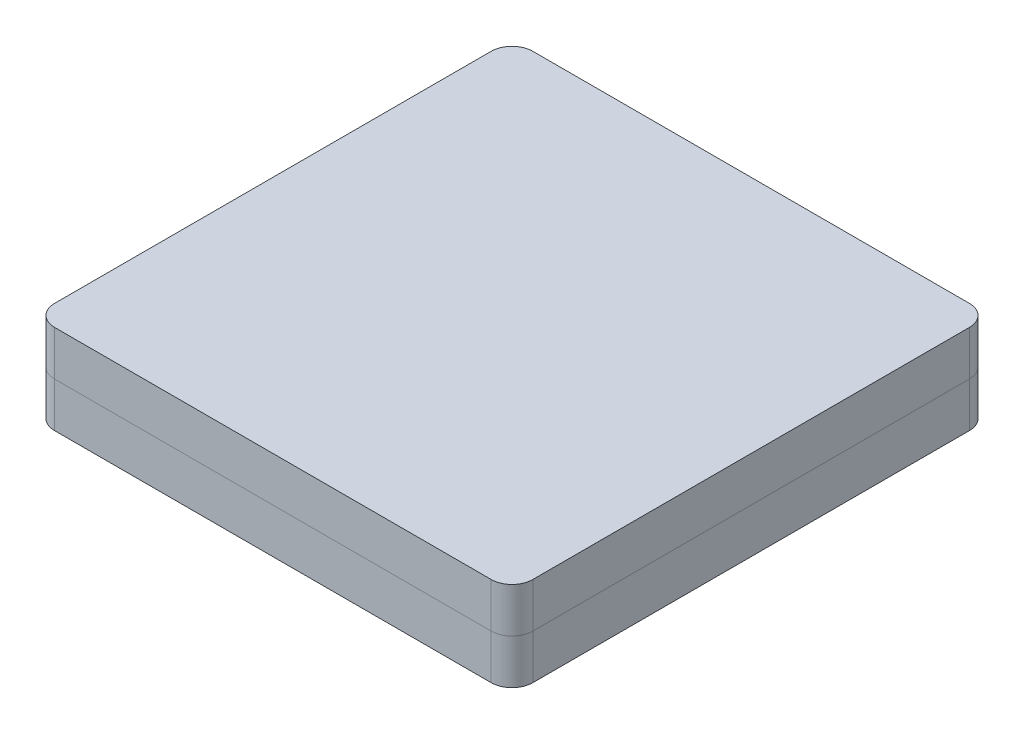
ISO-10303-21;
HEADER;
FILE_DESCRIPTION(('STEP AP214'),'2;1');
FILE_NAME('part.step','',(''),(''),'','','');
FILE_SCHEMA(('AUTOMOTIVE_DESIGN { 1 0 10303 214 1 1 1 1 }'));
ENDSEC;
DATA;
#1=APPLICATION_CONTEXT('core data for automotive mechanical design processes');
#2=APPLICATION_PROTOCOL_DEFINITION('international standard','automotive_design',2000,#1);
#3=PRODUCT_CONTEXT('',#1,'mechanical');
#4=PRODUCT('Part','Part','',(#3));
#5=PRODUCT_RELATED_PRODUCT_CATEGORY('part','',(#4));
#6=PRODUCT_DEFINITION_FORMATION('','',#4);
#7=PRODUCT_DEFINITION_CONTEXT('part definition',#1,'design');
#8=PRODUCT_DEFINITION('design','',#6,#7);
#9=PRODUCT_DEFINITION_SHAPE('','',#8);
#10=(LENGTH_UNIT() NAMED_UNIT(*) SI_UNIT(.MILLI.,.METRE.));
#11=(NAMED_UNIT(*) PLANE_ANGLE_UNIT() SI_UNIT($,.RADIAN.));
#12=(NAMED_UNIT(*) SI_UNIT($,.STERADIAN.) SOLID_ANGLE_UNIT());
#13=UNCERTAINTY_MEASURE_WITH_UNIT(LENGTH_MEASURE(1.E-05),#10,'distance_accuracy_value','');
#14=(GEOMETRIC_REPRESENTATION_CONTEXT(3) GLOBAL_UNCERTAINTY_ASSIGNED_CONTEXT((#13)) GLOBAL_UNIT_ASSIGNED_CONTEXT((#10,
#11,#12)) REPRESENTATION_CONTEXT('',''));
#15=CARTESIAN_POINT('',(0.,0.,0.));
#16=DIRECTION('',(0.,0.,1.));
#17=DIRECTION('',(1.,0.,0.));
#18=AXIS2_PLACEMENT_3D('',#15,#16,#17);
#19=CARTESIAN_POINT('',(0.,2.15,0.));
#20=DIRECTION('',(0.,1.,0.));
#21=DIRECTION('',(0.,0.,1.));
#22=AXIS2_PLACEMENT_3D('',#19,#20,#21);
#23=PLANE('',#22);
#24=DIRECTION('',(0.,0.,1.));
#25=VECTOR('',#24,1.);
#26=CARTESIAN_POINT('',(-11.5,2.15,10.5));
#27=LINE('',#26,#25);
#28=CARTESIAN_POINT('',(-11.5,2.15,-10.5));
#29=VERTEX_POINT('',#28);
#30=CARTESIAN_POINT('',(-11.5,2.15,10.5));
#31=VERTEX_POINT('',#30);
#32=EDGE_CURVE('E120',#29,#31,#27,.T.);
#33=ORIENTED_EDGE('',*,*,#32,.T.);
#34=CARTESIAN_POINT('',(-10.5,2.15,10.5));
#35=DIRECTION('',(0.,1.,0.));
#36=DIRECTION('',(0.,0.,1.));
#37=AXIS2_PLACEMENT_3D('',#34,#35,#36);
#38=CIRCLE('',#37,0.999999999999999);
#39=CARTESIAN_POINT('',(-10.5,2.15,11.5));
#40=VERTEX_POINT('',#39);
#41=EDGE_CURVE('E127',#31,#40,#38,.T.);
#42=ORIENTED_EDGE('',*,*,#41,.T.);
#43=DIRECTION('',(1.,0.,0.));
#44=VECTOR('',#43,1.);
#45=CARTESIAN_POINT('',(-10.5,2.15,11.5));
#46=LINE('',#45,#44);
#47=CARTESIAN_POINT('',(10.5,2.15,11.5));
#48=VERTEX_POINT('',#47);
#49=EDGE_CURVE('E131',#40,#48,#46,.T.);
#50=ORIENTED_EDGE('',*,*,#49,.T.);
#51=CARTESIAN_POINT('',(10.5,2.15,10.5));
#52=DIRECTION('',(0.,1.,0.));
#53=DIRECTION('',(0.,0.,1.));
#54=AXIS2_PLACEMENT_3D('',#51,#52,#53);
#55=CIRCLE('',#54,0.999999999999999);
#56=CARTESIAN_POINT('',(11.5,2.15,10.5));
#57=VERTEX_POINT('',#56);
#58=EDGE_CURVE('E175',#48,#57,#55,.T.);
#59=ORIENTED_EDGE('',*,*,#58,.T.);
#60=DIRECTION('',(0.,0.,-1.));
#61=VECTOR('',#60,1.);
#62=CARTESIAN_POINT('',(11.5,2.15,10.5));
#63=LINE('',#62,#61);
#64=CARTESIAN_POINT('',(11.5,2.15,-10.5));
#65=VERTEX_POINT('',#64);
#66=EDGE_CURVE('E178',#57,#65,#63,.T.);
#67=ORIENTED_EDGE('',*,*,#66,.T.);
#68=CARTESIAN_POINT('',(10.5,2.15,-10.5));
#69=DIRECTION('',(0.,1.,0.));
#70=DIRECTION('',(0.,0.,1.));
#71=AXIS2_PLACEMENT_3D('',#68,#69,#70);
#72=CIRCLE('',#71,0.999999999999999);
#73=CARTESIAN_POINT('',(10.5,2.15,-11.5));
#74=VERTEX_POINT('',#73);
#75=EDGE_CURVE('E181',#65,#74,#72,.T.);
#76=ORIENTED_EDGE('',*,*,#75,.T.);
#77=DIRECTION('',(-1.,0.,0.));
#78=VECTOR('',#77,1.);
#79=CARTESIAN_POINT('',(-10.5,2.15,-11.5));
#80=LINE('',#79,#78);
#81=CARTESIAN_POINT('',(-10.5,2.15,-11.5));
#82=VERTEX_POINT('',#81);
#83=EDGE_CURVE('E138',#74,#82,#80,.T.);
#84=ORIENTED_EDGE('',*,*,#83,.T.);
#85=CARTESIAN_POINT('',(-10.5,2.15,-10.5));
#86=DIRECTION('',(0.,1.,0.));
#87=DIRECTION('',(0.,0.,1.));
#88=AXIS2_PLACEMENT_3D('',#85,#86,#87);
#89=CIRCLE('',#88,0.999999999999999);
#90=EDGE_CURVE('E136',#82,#29,#89,.T.);
#91=ORIENTED_EDGE('',*,*,#90,.T.);
#92=EDGE_LOOP('',(#33,#42,#50,#59,#67,#76,#84,#91));
#93=FACE_BOUND('',#92,.T.);
#94=ADVANCED_FACE('F50',(#93),#23,.T.);
#95=CARTESIAN_POINT('',(-10.5,4.3,10.5));
#96=DIRECTION('',(0.,-1.,0.));
#97=DIRECTION('',(0.,0.,-1.));
#98=AXIS2_PLACEMENT_3D('',#95,#96,#97);
#99=CYLINDRICAL_SURFACE('',#98,0.999999999999999);
#100=ORIENTED_EDGE('',*,*,#41,.F.);
#101=DIRECTION('',(0.,-1.,0.));
#102=VECTOR('',#101,1.);
#103=CARTESIAN_POINT('',(-11.5,4.3,10.5));
#104=LINE('',#103,#102);
#105=CARTESIAN_POINT('',(-11.5,0.,10.5));
#106=VERTEX_POINT('',#105);
#107=EDGE_CURVE('E54',#31,#106,#104,.T.);
#108=ORIENTED_EDGE('',*,*,#107,.T.);
#109=CARTESIAN_POINT('',(-10.5,0.,10.5));
#110=DIRECTION('',(0.,1.,0.));
#111=DIRECTION('',(0.,0.,-1.));
#112=AXIS2_PLACEMENT_3D('',#109,#110,#111);
#113=CIRCLE('',#112,0.999999999999999);
#114=CARTESIAN_POINT('',(-10.5,0.,11.5));
#115=VERTEX_POINT('',#114);
#116=EDGE_CURVE('E13',#106,#115,#113,.T.);
#117=ORIENTED_EDGE('',*,*,#116,.T.);
#118=DIRECTION('',(0.,-1.,0.));
#119=VECTOR('',#118,1.);
#120=CARTESIAN_POINT('',(-10.5,4.3,11.5));
#121=LINE('',#120,#119);
#122=EDGE_CURVE('E67',#40,#115,#121,.T.);
#123=ORIENTED_EDGE('',*,*,#122,.F.);
#124=EDGE_LOOP('',(#100,#108,#117,#123));
#125=FACE_BOUND('',#124,.T.);
#126=ADVANCED_FACE('F128',(#125),#99,.T.);
#127=CARTESIAN_POINT('',(-10.5,4.3,11.5));
#128=DIRECTION('',(0.,0.,-1.));
#129=DIRECTION('',(-1.,0.,0.));
#130=AXIS2_PLACEMENT_3D('',#127,#128,#129);
#131=PLANE('',#130);
#132=ORIENTED_EDGE('',*,*,#49,.F.);
#133=ORIENTED_EDGE('',*,*,#122,.T.);
#134=DIRECTION('',(1.,0.,0.));
#135=VECTOR('',#134,1.);
#136=CARTESIAN_POINT('',(-10.5,0.,11.5));
#137=LINE('',#136,#135);
#138=CARTESIAN_POINT('',(10.5,0.,11.5));
#139=VERTEX_POINT('',#138);
#140=EDGE_CURVE('E59',#115,#139,#137,.T.);
#141=ORIENTED_EDGE('',*,*,#140,.T.);
#142=DIRECTION('',(0.,-1.,0.));
#143=VECTOR('',#142,1.);
#144=CARTESIAN_POINT('',(10.5,4.3,11.5));
#145=LINE('',#144,#143);
#146=EDGE_CURVE('E75',#48,#139,#145,.T.);
#147=ORIENTED_EDGE('',*,*,#146,.F.);
#148=EDGE_LOOP('',(#132,#133,#141,#147));
#149=FACE_BOUND('',#148,.T.);
#150=ADVANCED_FACE('F196',(#149),#131,.F.);
#151=CARTESIAN_POINT('',(10.5,4.3,10.5));
#152=DIRECTION('',(0.,-1.,0.));
#153=DIRECTION('',(0.,0.,-1.));
#154=AXIS2_PLACEMENT_3D('',#151,#152,#153);
#155=CYLINDRICAL_SURFACE('',#154,0.999999999999999);
#156=ORIENTED_EDGE('',*,*,#58,.F.);
#157=ORIENTED_EDGE('',*,*,#146,.T.);
#158=CARTESIAN_POINT('',(10.5,0.,10.5));
#159=DIRECTION('',(0.,1.,0.));
#160=DIRECTION('',(0.,0.,1.));
#161=AXIS2_PLACEMENT_3D('',#158,#159,#160);
#162=CIRCLE('',#161,0.999999999999999);
#163=CARTESIAN_POINT('',(11.5,0.,10.5));
#164=VERTEX_POINT('',#163);
#165=EDGE_CURVE('E171',#139,#164,#162,.T.);
#166=ORIENTED_EDGE('',*,*,#165,.T.);
#167=DIRECTION('',(0.,-1.,0.));
#168=VECTOR('',#167,1.);
#169=CARTESIAN_POINT('',(11.5,4.3,10.5));
#170=LINE('',#169,#168);
#171=EDGE_CURVE('E144',#57,#164,#170,.T.);
#172=ORIENTED_EDGE('',*,*,#171,.F.);
#173=EDGE_LOOP('',(#156,#157,#166,#172));
#174=FACE_BOUND('',#173,.T.);
#175=ADVANCED_FACE('F195',(#174),#155,.T.);
#176=CARTESIAN_POINT('',(11.5,4.3,10.5));
#177=DIRECTION('',(-1.,0.,0.));
#178=DIRECTION('',(0.,0.,1.));
#179=AXIS2_PLACEMENT_3D('',#176,#177,#178);
#180=PLANE('',#179);
#181=ORIENTED_EDGE('',*,*,#66,.F.);
#182=ORIENTED_EDGE('',*,*,#171,.T.);
#183=DIRECTION('',(0.,0.,-1.));
#184=VECTOR('',#183,1.);
#185=CARTESIAN_POINT('',(11.5,0.,10.5));
#186=LINE('',#185,#184);
#187=CARTESIAN_POINT('',(11.5,0.,-10.5));
#188=VERTEX_POINT('',#187);
#189=EDGE_CURVE('E168',#164,#188,#186,.T.);
#190=ORIENTED_EDGE('',*,*,#189,.T.);
#191=DIRECTION('',(0.,-1.,0.));
#192=VECTOR('',#191,1.);
#193=CARTESIAN_POINT('',(11.5,4.3,-10.5));
#194=LINE('',#193,#192);
#195=EDGE_CURVE('E146',#65,#188,#194,.T.);
#196=ORIENTED_EDGE('',*,*,#195,.F.);
#197=EDGE_LOOP('',(#181,#182,#190,#196));
#198=FACE_BOUND('',#197,.T.);
#199=ADVANCED_FACE('F194',(#198),#180,.F.);
#200=CARTESIAN_POINT('',(10.5,4.3,-10.5));
#201=DIRECTION('',(0.,-1.,0.));
#202=DIRECTION('',(0.,0.,-1.));
#203=AXIS2_PLACEMENT_3D('',#200,#201,#202);
#204=CYLINDRICAL_SURFACE('',#203,0.999999999999999);
#205=ORIENTED_EDGE('',*,*,#75,.F.);
#206=ORIENTED_EDGE('',*,*,#195,.T.);
#207=CARTESIAN_POINT('',(10.5,0.,-10.5));
#208=DIRECTION('',(0.,1.,0.));
#209=DIRECTION('',(0.,0.,-1.));
#210=AXIS2_PLACEMENT_3D('',#207,#208,#209);
#211=CIRCLE('',#210,0.999999999999999);
#212=CARTESIAN_POINT('',(10.5,0.,-11.5));
#213=VERTEX_POINT('',#212);
#214=EDGE_CURVE('E165',#188,#213,#211,.T.);
#215=ORIENTED_EDGE('',*,*,#214,.T.);
#216=DIRECTION('',(0.,-1.,0.));
#217=VECTOR('',#216,1.);
#218=CARTESIAN_POINT('',(10.5,4.3,-11.5));
#219=LINE('',#218,#217);
#220=EDGE_CURVE('E148',#74,#213,#219,.T.);
#221=ORIENTED_EDGE('',*,*,#220,.F.);
#222=EDGE_LOOP('',(#205,#206,#215,#221));
#223=FACE_BOUND('',#222,.T.);
#224=ADVANCED_FACE('F191',(#223),#204,.T.);
#225=CARTESIAN_POINT('',(-10.5,4.3,-11.5));
#226=DIRECTION('',(0.,0.,1.));
#227=DIRECTION('',(1.,0.,0.));
#228=AXIS2_PLACEMENT_3D('',#225,#226,#227);
#229=PLANE('',#228);
#230=ORIENTED_EDGE('',*,*,#83,.F.);
#231=ORIENTED_EDGE('',*,*,#220,.T.);
#232=DIRECTION('',(-1.,0.,0.));
#233=VECTOR('',#232,1.);
#234=CARTESIAN_POINT('',(-10.5,0.,-11.5));
#235=LINE('',#234,#233);
#236=CARTESIAN_POINT('',(-10.5,0.,-11.5));
#237=VERTEX_POINT('',#236);
#238=EDGE_CURVE('E159',#213,#237,#235,.T.);
#239=ORIENTED_EDGE('',*,*,#238,.T.);
#240=DIRECTION('',(0.,-1.,0.));
#241=VECTOR('',#240,1.);
#242=CARTESIAN_POINT('',(-10.5,4.3,-11.5));
#243=LINE('',#242,#241);
#244=EDGE_CURVE('E150',#82,#237,#243,.T.);
#245=ORIENTED_EDGE('',*,*,#244,.F.);
#246=EDGE_LOOP('',(#230,#231,#239,#245));
#247=FACE_BOUND('',#246,.T.);
#248=ADVANCED_FACE('F186',(#247),#229,.F.);
#249=CARTESIAN_POINT('',(-10.5,4.3,-10.5));
#250=DIRECTION('',(0.,-1.,0.));
#251=DIRECTION('',(0.,0.,-1.));
#252=AXIS2_PLACEMENT_3D('',#249,#250,#251);
#253=CYLINDRICAL_SURFACE('',#252,0.999999999999999);
#254=ORIENTED_EDGE('',*,*,#90,.F.);
#255=ORIENTED_EDGE('',*,*,#244,.T.);
#256=CARTESIAN_POINT('',(-10.5,0.,-10.5));
#257=DIRECTION('',(0.,1.,0.));
#258=DIRECTION('',(0.,0.,-1.));
#259=AXIS2_PLACEMENT_3D('',#256,#257,#258);
#260=CIRCLE('',#259,0.999999999999999);
#261=CARTESIAN_POINT('',(-11.5,0.,-10.5));
#262=VERTEX_POINT('',#261);
#263=EDGE_CURVE('E154',#237,#262,#260,.T.);
#264=ORIENTED_EDGE('',*,*,#263,.T.);
#265=DIRECTION('',(0.,-1.,0.));
#266=VECTOR('',#265,1.);
#267=CARTESIAN_POINT('',(-11.5,4.3,-10.5));
#268=LINE('',#267,#266);
#269=EDGE_CURVE('E125',#29,#262,#268,.T.);
#270=ORIENTED_EDGE('',*,*,#269,.F.);
#271=EDGE_LOOP('',(#254,#255,#264,#270));
#272=FACE_BOUND('',#271,.T.);
#273=ADVANCED_FACE('F155',(#272),#253,.T.);
#274=CARTESIAN_POINT('',(-11.5,4.3,10.5));
#275=DIRECTION('',(1.,0.,0.));
#276=DIRECTION('',(0.,0.,-1.));
#277=AXIS2_PLACEMENT_3D('',#274,#275,#276);
#278=PLANE('',#277);
#279=ORIENTED_EDGE('',*,*,#32,.F.);
#280=ORIENTED_EDGE('',*,*,#269,.T.);
#281=DIRECTION('',(0.,0.,1.));
#282=VECTOR('',#281,1.);
#283=CARTESIAN_POINT('',(-11.5,0.,10.5));
#284=LINE('',#283,#282);
#285=EDGE_CURVE('E122',#262,#106,#284,.T.);
#286=ORIENTED_EDGE('',*,*,#285,.T.);
#287=ORIENTED_EDGE('',*,*,#107,.F.);
#288=EDGE_LOOP('',(#279,#280,#286,#287));
#289=FACE_BOUND('',#288,.T.);
#290=ADVANCED_FACE('F52',(#289),#278,.F.);
#291=CARTESIAN_POINT('',(-10.5,0.,10.5));
#292=DIRECTION('',(0.,-1.,0.));
#293=DIRECTION('',(0.,0.,-1.));
#294=AXIS2_PLACEMENT_3D('',#291,#292,#293);
#295=PLANE('',#294);
#296=ORIENTED_EDGE('',*,*,#116,.F.);
#297=ORIENTED_EDGE('',*,*,#285,.F.);
#298=ORIENTED_EDGE('',*,*,#263,.F.);
#299=ORIENTED_EDGE('',*,*,#238,.F.);
#300=ORIENTED_EDGE('',*,*,#214,.F.);
#301=ORIENTED_EDGE('',*,*,#189,.F.);
#302=ORIENTED_EDGE('',*,*,#165,.F.);
#303=ORIENTED_EDGE('',*,*,#140,.F.);
#304=EDGE_LOOP('',(#296,#297,#298,#299,#300,#301,#302,#303));
#305=FACE_BOUND('',#304,.T.);
#306=ADVANCED_FACE('F161',(#305),#295,.T.);
#307=CLOSED_SHELL('',(#94,#126,#150,#175,#199,#224,#248,#273,#290,#306));
#308=MANIFOLD_SOLID_BREP('B2',#307);
#309=CARTESIAN_POINT('',(0.,2.15,0.));
#310=DIRECTION('',(0.,1.,0.));
#311=DIRECTION('',(0.,0.,1.));
#312=AXIS2_PLACEMENT_3D('',#309,#310,#311);
#313=PLANE('',#312);
#314=DIRECTION('',(0.,0.,1.));
#315=VECTOR('',#314,1.);
#316=CARTESIAN_POINT('',(-11.5,2.15,10.5));
#317=LINE('',#316,#315);
#318=CARTESIAN_POINT('',(-11.5,2.15,-10.5));
#319=VERTEX_POINT('',#318);
#320=CARTESIAN_POINT('',(-11.5,2.15,10.5));
#321=VERTEX_POINT('',#320);
#322=EDGE_CURVE('E356',#319,#321,#317,.T.);
#323=ORIENTED_EDGE('',*,*,#322,.F.);
#324=CARTESIAN_POINT('',(-10.5,2.15,-10.5));
#325=DIRECTION('',(0.,1.,0.));
#326=DIRECTION('',(0.,0.,1.));
#327=AXIS2_PLACEMENT_3D('',#324,#325,#326);
#328=CIRCLE('',#327,0.999999999999999);
#329=CARTESIAN_POINT('',(-10.5,2.15,-11.5));
#330=VERTEX_POINT('',#329);
#331=EDGE_CURVE('E359',#330,#319,#328,.T.);
#332=ORIENTED_EDGE('',*,*,#331,.F.);
#333=DIRECTION('',(-1.,0.,0.));
#334=VECTOR('',#333,1.);
#335=CARTESIAN_POINT('',(-10.5,2.15,-11.5));
#336=LINE('',#335,#334);
#337=CARTESIAN_POINT('',(10.5,2.15,-11.5));
#338=VERTEX_POINT('',#337);
#339=EDGE_CURVE('E366',#338,#330,#336,.T.);
#340=ORIENTED_EDGE('',*,*,#339,.F.);
#341=CARTESIAN_POINT('',(10.5,2.15,-10.5));
#342=DIRECTION('',(0.,1.,0.));
#343=DIRECTION('',(0.,0.,1.));
#344=AXIS2_PLACEMENT_3D('',#341,#342,#343);
#345=CIRCLE('',#344,0.999999999999999);
#346=CARTESIAN_POINT('',(11.5,2.15,-10.5));
#347=VERTEX_POINT('',#346);
#348=EDGE_CURVE('E368',#347,#338,#345,.T.);
#349=ORIENTED_EDGE('',*,*,#348,.F.);
#350=DIRECTION('',(0.,0.,-1.));
#351=VECTOR('',#350,1.);
#352=CARTESIAN_POINT('',(11.5,2.15,10.5));
#353=LINE('',#352,#351);
#354=CARTESIAN_POINT('',(11.5,2.15,10.5));
#355=VERTEX_POINT('',#354);
#356=EDGE_CURVE('E370',#355,#347,#353,.T.);
#357=ORIENTED_EDGE('',*,*,#356,.F.);
#358=CARTESIAN_POINT('',(10.5,2.15,10.5));
#359=DIRECTION('',(0.,1.,0.));
#360=DIRECTION('',(0.,0.,1.));
#361=AXIS2_PLACEMENT_3D('',#358,#359,#360);
#362=CIRCLE('',#361,0.999999999999999);
#363=CARTESIAN_POINT('',(10.5,2.15,11.5));
#364=VERTEX_POINT('',#363);
#365=EDGE_CURVE('E372',#364,#355,#362,.T.);
#366=ORIENTED_EDGE('',*,*,#365,.F.);
#367=DIRECTION('',(1.,0.,0.));
#368=VECTOR('',#367,1.);
#369=CARTESIAN_POINT('',(-10.5,2.15,11.5));
#370=LINE('',#369,#368);
#371=CARTESIAN_POINT('',(-10.5,2.15,11.5));
#372=VERTEX_POINT('',#371);
#373=EDGE_CURVE('E285',#372,#364,#370,.T.);
#374=ORIENTED_EDGE('',*,*,#373,.F.);
#375=CARTESIAN_POINT('',(-10.5,2.15,10.5));
#376=DIRECTION('',(0.,1.,0.));
#377=DIRECTION('',(0.,0.,1.));
#378=AXIS2_PLACEMENT_3D('',#375,#376,#377);
#379=CIRCLE('',#378,0.999999999999999);
#380=EDGE_CURVE('E48',#321,#372,#379,.T.);
#381=ORIENTED_EDGE('',*,*,#380,.F.);
#382=EDGE_LOOP('',(#323,#332,#340,#349,#357,#366,#374,#381));
#383=FACE_BOUND('',#382,.T.);
#384=ADVANCED_FACE('F278',(#383),#313,.F.);
#385=CARTESIAN_POINT('',(-10.5,4.3,11.5));
#386=DIRECTION('',(0.,0.,-1.));
#387=DIRECTION('',(-1.,0.,0.));
#388=AXIS2_PLACEMENT_3D('',#385,#386,#387);
#389=PLANE('',#388);
#390=DIRECTION('',(0.,-1.,0.));
#391=VECTOR('',#390,1.);
#392=CARTESIAN_POINT('',(-10.5,4.3,11.5));
#393=LINE('',#392,#391);
#394=CARTESIAN_POINT('',(-10.5,4.3,11.5));
#395=VERTEX_POINT('',#394);
#396=EDGE_CURVE('E341',#395,#372,#393,.T.);
#397=ORIENTED_EDGE('',*,*,#396,.T.);
#398=ORIENTED_EDGE('',*,*,#373,.T.);
#399=DIRECTION('',(0.,-1.,0.));
#400=VECTOR('',#399,1.);
#401=CARTESIAN_POINT('',(10.5,4.3,11.5));
#402=LINE('',#401,#400);
#403=CARTESIAN_POINT('',(10.5,4.3,11.5));
#404=VERTEX_POINT('',#403);
#405=EDGE_CURVE('E343',#404,#364,#402,.T.);
#406=ORIENTED_EDGE('',*,*,#405,.F.);
#407=DIRECTION('',(1.,0.,0.));
#408=VECTOR('',#407,1.);
#409=CARTESIAN_POINT('',(-10.5,4.3,11.5));
#410=LINE('',#409,#408);
#411=EDGE_CURVE('E338',#395,#404,#410,.T.);
#412=ORIENTED_EDGE('',*,*,#411,.F.);
#413=EDGE_LOOP('',(#397,#398,#406,#412));
#414=FACE_BOUND('',#413,.T.);
#415=ADVANCED_FACE('F340',(#414),#389,.F.);
#416=CARTESIAN_POINT('',(10.5,4.3,10.5));
#417=DIRECTION('',(0.,-1.,0.));
#418=DIRECTION('',(0.,0.,-1.));
#419=AXIS2_PLACEMENT_3D('',#416,#417,#418);
#420=CYLINDRICAL_SURFACE('',#419,0.999999999999999);
#421=ORIENTED_EDGE('',*,*,#405,.T.);
#422=ORIENTED_EDGE('',*,*,#365,.T.);
#423=DIRECTION('',(0.,-1.,0.));
#424=VECTOR('',#423,1.);
#425=CARTESIAN_POINT('',(11.5,4.3,10.5));
#426=LINE('',#425,#424);
#427=CARTESIAN_POINT('',(11.5,4.3,10.5));
#428=VERTEX_POINT('',#427);
#429=EDGE_CURVE('E361',#428,#355,#426,.T.);
#430=ORIENTED_EDGE('',*,*,#429,.F.);
#431=CARTESIAN_POINT('',(10.5,4.3,10.5));
#432=DIRECTION('',(0.,1.,0.));
#433=DIRECTION('',(0.,0.,1.));
#434=AXIS2_PLACEMENT_3D('',#431,#432,#433);
#435=CIRCLE('',#434,0.999999999999999);
#436=EDGE_CURVE('E346',#404,#428,#435,.T.);
#437=ORIENTED_EDGE('',*,*,#436,.F.);
#438=EDGE_LOOP('',(#421,#422,#430,#437));
#439=FACE_BOUND('',#438,.T.);
#440=ADVANCED_FACE('F376',(#439),#420,.T.);
#441=CARTESIAN_POINT('',(11.5,4.3,10.5));
#442=DIRECTION('',(-1.,0.,0.));
#443=DIRECTION('',(0.,0.,1.));
#444=AXIS2_PLACEMENT_3D('',#441,#442,#443);
#445=PLANE('',#444);
#446=ORIENTED_EDGE('',*,*,#429,.T.);
#447=ORIENTED_EDGE('',*,*,#356,.T.);
#448=DIRECTION('',(0.,-1.,0.));
#449=VECTOR('',#448,1.);
#450=CARTESIAN_POINT('',(11.5,4.3,-10.5));
#451=LINE('',#450,#449);
#452=CARTESIAN_POINT('',(11.5,4.3,-10.5));
#453=VERTEX_POINT('',#452);
#454=EDGE_CURVE('E388',#453,#347,#451,.T.);
#455=ORIENTED_EDGE('',*,*,#454,.F.);
#456=DIRECTION('',(0.,0.,-1.));
#457=VECTOR('',#456,1.);
#458=CARTESIAN_POINT('',(11.5,4.3,10.5));
#459=LINE('',#458,#457);
#460=EDGE_CURVE('E387',#428,#453,#459,.T.);
#461=ORIENTED_EDGE('',*,*,#460,.F.);
#462=EDGE_LOOP('',(#446,#447,#455,#461));
#463=FACE_BOUND('',#462,.T.);
#464=ADVANCED_FACE('F386',(#463),#445,.F.);
#465=CARTESIAN_POINT('',(10.5,4.3,-10.5));
#466=DIRECTION('',(0.,-1.,0.));
#467=DIRECTION('',(0.,0.,-1.));
#468=AXIS2_PLACEMENT_3D('',#465,#466,#467);
#469=CYLINDRICAL_SURFACE('',#468,0.999999999999999);
#470=ORIENTED_EDGE('',*,*,#454,.T.);
#471=ORIENTED_EDGE('',*,*,#348,.T.);
#472=DIRECTION('',(0.,-1.,0.));
#473=VECTOR('',#472,1.);
#474=CARTESIAN_POINT('',(10.5,4.3,-11.5));
#475=LINE('',#474,#473);
#476=CARTESIAN_POINT('',(10.5,4.3,-11.5));
#477=VERTEX_POINT('',#476);
#478=EDGE_CURVE('E389',#477,#338,#475,.T.);
#479=ORIENTED_EDGE('',*,*,#478,.F.);
#480=CARTESIAN_POINT('',(10.5,4.3,-10.5));
#481=DIRECTION('',(0.,1.,0.));
#482=DIRECTION('',(0.,0.,-1.));
#483=AXIS2_PLACEMENT_3D('',#480,#481,#482);
#484=CIRCLE('',#483,0.999999999999999);
#485=EDGE_CURVE('E407',#453,#477,#484,.T.);
#486=ORIENTED_EDGE('',*,*,#485,.F.);
#487=EDGE_LOOP('',(#470,#471,#479,#486));
#488=FACE_BOUND('',#487,.T.);
#489=ADVANCED_FACE('F413',(#488),#469,.T.);
#490=CARTESIAN_POINT('',(-10.5,4.3,-11.5));
#491=DIRECTION('',(0.,0.,1.));
#492=DIRECTION('',(1.,0.,0.));
#493=AXIS2_PLACEMENT_3D('',#490,#491,#492);
#494=PLANE('',#493);
#495=ORIENTED_EDGE('',*,*,#478,.T.);
#496=ORIENTED_EDGE('',*,*,#339,.T.);
#497=DIRECTION('',(0.,-1.,0.));
#498=VECTOR('',#497,1.);
#499=CARTESIAN_POINT('',(-10.5,4.3,-11.5));
#500=LINE('',#499,#498);
#501=CARTESIAN_POINT('',(-10.5,4.3,-11.5));
#502=VERTEX_POINT('',#501);
#503=EDGE_CURVE('E394',#502,#330,#500,.T.);
#504=ORIENTED_EDGE('',*,*,#503,.F.);
#505=DIRECTION('',(-1.,0.,0.));
#506=VECTOR('',#505,1.);
#507=CARTESIAN_POINT('',(-10.5,4.3,-11.5));
#508=LINE('',#507,#506);
#509=EDGE_CURVE('E405',#477,#502,#508,.T.);
#510=ORIENTED_EDGE('',*,*,#509,.F.);
#511=EDGE_LOOP('',(#495,#496,#504,#510));
#512=FACE_BOUND('',#511,.T.);
#513=ADVANCED_FACE('F417',(#512),#494,.F.);
#514=CARTESIAN_POINT('',(-10.5,4.3,10.5));
#515=DIRECTION('',(0.,-1.,0.));
#516=DIRECTION('',(0.,0.,-1.));
#517=AXIS2_PLACEMENT_3D('',#514,#515,#516);
#518=PLANE('',#517);
#519=CARTESIAN_POINT('',(-10.5,4.3,10.5));
#520=DIRECTION('',(0.,1.,0.));
#521=DIRECTION('',(0.,0.,-1.));
#522=AXIS2_PLACEMENT_3D('',#519,#520,#521);
#523=CIRCLE('',#522,0.999999999999999);
#524=CARTESIAN_POINT('',(-11.5,4.3,10.5));
#525=VERTEX_POINT('',#524);
#526=EDGE_CURVE('E347',#525,#395,#523,.T.);
#527=ORIENTED_EDGE('',*,*,#526,.T.);
#528=ORIENTED_EDGE('',*,*,#411,.T.);
#529=ORIENTED_EDGE('',*,*,#436,.T.);
#530=ORIENTED_EDGE('',*,*,#460,.T.);
#531=ORIENTED_EDGE('',*,*,#485,.T.);
#532=ORIENTED_EDGE('',*,*,#509,.T.);
#533=CARTESIAN_POINT('',(-10.5,4.3,-10.5));
#534=DIRECTION('',(0.,1.,0.));
#535=DIRECTION('',(0.,0.,-1.));
#536=AXIS2_PLACEMENT_3D('',#533,#534,#535);
#537=CIRCLE('',#536,0.999999999999999);
#538=CARTESIAN_POINT('',(-11.5,4.3,-10.5));
#539=VERTEX_POINT('',#538);
#540=EDGE_CURVE('E403',#502,#539,#537,.T.);
#541=ORIENTED_EDGE('',*,*,#540,.T.);
#542=DIRECTION('',(0.,0.,1.));
#543=VECTOR('',#542,1.);
#544=CARTESIAN_POINT('',(-11.5,4.3,10.5));
#545=LINE('',#544,#543);
#546=EDGE_CURVE('E352',#539,#525,#545,.T.);
#547=ORIENTED_EDGE('',*,*,#546,.T.);
#548=EDGE_LOOP('',(#527,#528,#529,#530,#531,#532,#541,#547));
#549=FACE_BOUND('',#548,.T.);
#550=ADVANCED_FACE('F350',(#549),#518,.F.);
#551=CARTESIAN_POINT('',(-10.5,4.3,10.5));
#552=DIRECTION('',(0.,-1.,0.));
#553=DIRECTION('',(0.,0.,-1.));
#554=AXIS2_PLACEMENT_3D('',#551,#552,#553);
#555=CYLINDRICAL_SURFACE('',#554,0.999999999999999);
#556=DIRECTION('',(0.,-1.,0.));
#557=VECTOR('',#556,1.);
#558=CARTESIAN_POINT('',(-11.5,4.3,10.5));
#559=LINE('',#558,#557);
#560=EDGE_CURVE('E400',#525,#321,#559,.T.);
#561=ORIENTED_EDGE('',*,*,#560,.T.);
#562=ORIENTED_EDGE('',*,*,#380,.T.);
#563=ORIENTED_EDGE('',*,*,#396,.F.);
#564=ORIENTED_EDGE('',*,*,#526,.F.);
#565=EDGE_LOOP('',(#561,#562,#563,#564));
#566=FACE_BOUND('',#565,.T.);
#567=ADVANCED_FACE('F355',(#566),#555,.T.);
#568=CARTESIAN_POINT('',(-10.5,4.3,-10.5));
#569=DIRECTION('',(0.,-1.,0.));
#570=DIRECTION('',(0.,0.,-1.));
#571=AXIS2_PLACEMENT_3D('',#568,#569,#570);
#572=CYLINDRICAL_SURFACE('',#571,0.999999999999999);
#573=ORIENTED_EDGE('',*,*,#503,.T.);
#574=ORIENTED_EDGE('',*,*,#331,.T.);
#575=DIRECTION('',(0.,-1.,0.));
#576=VECTOR('',#575,1.);
#577=CARTESIAN_POINT('',(-11.5,4.3,-10.5));
#578=LINE('',#577,#576);
#579=EDGE_CURVE('E397',#539,#319,#578,.T.);
#580=ORIENTED_EDGE('',*,*,#579,.F.);
#581=ORIENTED_EDGE('',*,*,#540,.F.);
#582=EDGE_LOOP('',(#573,#574,#580,#581));
#583=FACE_BOUND('',#582,.T.);
#584=ADVANCED_FACE('F421',(#583),#572,.T.);
#585=CARTESIAN_POINT('',(-11.5,4.3,10.5));
#586=DIRECTION('',(1.,0.,0.));
#587=DIRECTION('',(0.,0.,-1.));
#588=AXIS2_PLACEMENT_3D('',#585,#586,#587);
#589=PLANE('',#588);
#590=ORIENTED_EDGE('',*,*,#579,.T.);
#591=ORIENTED_EDGE('',*,*,#322,.T.);
#592=ORIENTED_EDGE('',*,*,#560,.F.);
#593=ORIENTED_EDGE('',*,*,#546,.F.);
#594=EDGE_LOOP('',(#590,#591,#592,#593));
#595=FACE_BOUND('',#594,.T.);
#596=ADVANCED_FACE('F424',(#595),#589,.F.);
#597=CLOSED_SHELL('',(#384,#415,#440,#464,#489,#513,#550,#567,#584,#596));
#598=MANIFOLD_SOLID_BREP('B7',#597);
#599=ADVANCED_BREP_SHAPE_REPRESENTATION('',(#18,#308,#598),#14);
#600=SHAPE_DEFINITION_REPRESENTATION(#9,#599);
ENDSEC;
END-ISO-10303-21;
